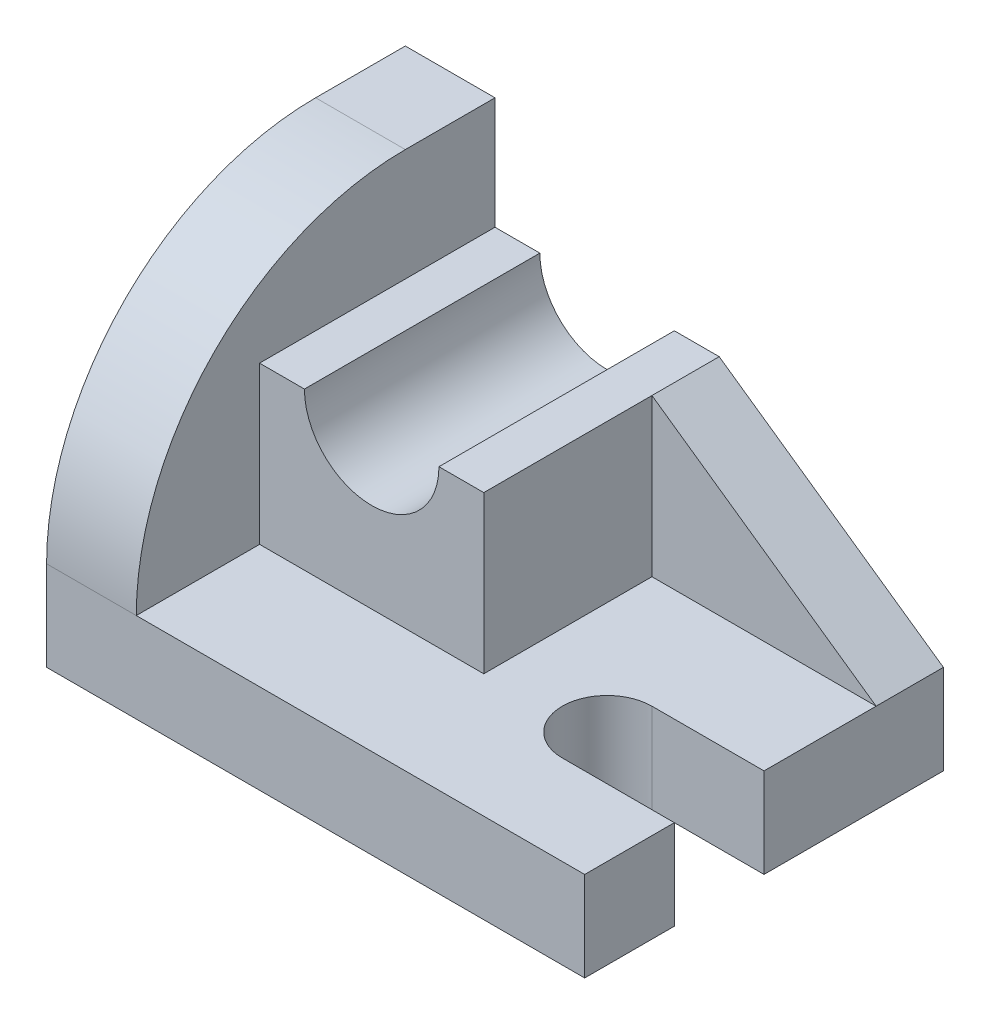
ISO-10303-21;
HEADER;
FILE_DESCRIPTION(('STEP AP214'),'2;1');
FILE_NAME('part.step','',(''),(''),'','','');
FILE_SCHEMA(('AUTOMOTIVE_DESIGN { 1 0 10303 214 1 1 1 1 }'));
ENDSEC;
DATA;
#1=APPLICATION_CONTEXT('core data for automotive mechanical design processes');
#2=APPLICATION_PROTOCOL_DEFINITION('international standard','automotive_design',2000,#1);
#3=PRODUCT_CONTEXT('',#1,'mechanical');
#4=PRODUCT('Part','Part','',(#3));
#5=PRODUCT_RELATED_PRODUCT_CATEGORY('part','',(#4));
#6=PRODUCT_DEFINITION_FORMATION('','',#4);
#7=PRODUCT_DEFINITION_CONTEXT('part definition',#1,'design');
#8=PRODUCT_DEFINITION('design','',#6,#7);
#9=PRODUCT_DEFINITION_SHAPE('','',#8);
#10=(LENGTH_UNIT() NAMED_UNIT(*) SI_UNIT(.MILLI.,.METRE.));
#11=(NAMED_UNIT(*) PLANE_ANGLE_UNIT() SI_UNIT($,.RADIAN.));
#12=(NAMED_UNIT(*) SI_UNIT($,.STERADIAN.) SOLID_ANGLE_UNIT());
#13=UNCERTAINTY_MEASURE_WITH_UNIT(LENGTH_MEASURE(1.E-05),#10,'distance_accuracy_value','');
#14=(GEOMETRIC_REPRESENTATION_CONTEXT(3) GLOBAL_UNCERTAINTY_ASSIGNED_CONTEXT((#13)) GLOBAL_UNIT_ASSIGNED_CONTEXT((#10,
#11,#12)) REPRESENTATION_CONTEXT('',''));
#15=CARTESIAN_POINT('',(0.,0.,0.));
#16=DIRECTION('',(0.,0.,1.));
#17=DIRECTION('',(1.,0.,0.));
#18=AXIS2_PLACEMENT_3D('',#15,#16,#17);
#19=CARTESIAN_POINT('',(48.,16.,-32.));
#20=DIRECTION('',(-1.,0.,0.));
#21=DIRECTION('',(0.,0.,1.));
#22=AXIS2_PLACEMENT_3D('',#19,#20,#21);
#23=PLANE('',#22);
#24=DIRECTION('',(0.,0.,-1.));
#25=VECTOR('',#24,1.);
#26=CARTESIAN_POINT('',(48.,16.,-32.));
#27=LINE('',#26,#25);
#28=CARTESIAN_POINT('',(48.,16.,0.));
#29=VERTEX_POINT('',#28);
#30=CARTESIAN_POINT('',(48.,16.,-20.));
#31=VERTEX_POINT('',#30);
#32=EDGE_CURVE('E241',#29,#31,#27,.T.);
#33=ORIENTED_EDGE('',*,*,#32,.F.);
#34=DIRECTION('',(0.,1.,0.));
#35=VECTOR('',#34,1.);
#36=CARTESIAN_POINT('',(48.,0.,0.));
#37=LINE('',#36,#35);
#38=CARTESIAN_POINT('',(48.,0.,0.));
#39=VERTEX_POINT('',#38);
#40=EDGE_CURVE('E180',#39,#29,#37,.T.);
#41=ORIENTED_EDGE('',*,*,#40,.F.);
#42=DIRECTION('',(0.,0.,-1.));
#43=VECTOR('',#42,1.);
#44=CARTESIAN_POINT('',(48.,0.,-32.));
#45=LINE('',#44,#43);
#46=CARTESIAN_POINT('',(48.,0.,-32.));
#47=VERTEX_POINT('',#46);
#48=EDGE_CURVE('E236',#39,#47,#45,.T.);
#49=ORIENTED_EDGE('',*,*,#48,.T.);
#50=DIRECTION('',(0.,-1.,0.));
#51=VECTOR('',#50,1.);
#52=CARTESIAN_POINT('',(48.,16.,-32.));
#53=LINE('',#52,#51);
#54=CARTESIAN_POINT('',(48.,16.,-32.));
#55=VERTEX_POINT('',#54);
#56=EDGE_CURVE('E260',#55,#47,#53,.T.);
#57=ORIENTED_EDGE('',*,*,#56,.F.);
#58=DIRECTION('',(0.,0.,-1.));
#59=VECTOR('',#58,1.);
#60=CARTESIAN_POINT('',(48.,16.,-20.));
#61=LINE('',#60,#59);
#62=EDGE_CURVE('E192',#31,#55,#61,.T.);
#63=ORIENTED_EDGE('',*,*,#62,.F.);
#64=EDGE_LOOP('',(#33,#41,#49,#57,#63));
#65=FACE_BOUND('',#64,.T.);
#66=ADVANCED_FACE('F33',(#65),#23,.F.);
#67=CARTESIAN_POINT('',(0.,16.,0.));
#68=DIRECTION('',(0.,1.,0.));
#69=DIRECTION('',(0.,0.,1.));
#70=AXIS2_PLACEMENT_3D('',#67,#68,#69);
#71=PLANE('',#70);
#72=DIRECTION('',(-1.,0.,0.));
#73=VECTOR('',#72,1.);
#74=CARTESIAN_POINT('',(28.,16.,0.));
#75=LINE('',#74,#73);
#76=CARTESIAN_POINT('',(28.,16.,0.));
#77=VERTEX_POINT('',#76);
#78=EDGE_CURVE('E168',#29,#77,#75,.T.);
#79=ORIENTED_EDGE('',*,*,#78,.F.);
#80=ORIENTED_EDGE('',*,*,#32,.T.);
#81=DIRECTION('',(-1.,0.,0.));
#82=VECTOR('',#81,1.);
#83=CARTESIAN_POINT('',(48.,16.,-20.));
#84=LINE('',#83,#82);
#85=CARTESIAN_POINT('',(8.00000000000002,16.,-20.));
#86=VERTEX_POINT('',#85);
#87=EDGE_CURVE('E183',#31,#86,#84,.T.);
#88=ORIENTED_EDGE('',*,*,#87,.T.);
#89=DIRECTION('',(0.,0.,1.));
#90=VECTOR('',#89,1.);
#91=CARTESIAN_POINT('',(8.00000000000002,16.,-32.));
#92=LINE('',#91,#90);
#93=CARTESIAN_POINT('',(8.00000000000003,16.,10.));
#94=VERTEX_POINT('',#93);
#95=EDGE_CURVE('E216',#86,#94,#92,.T.);
#96=ORIENTED_EDGE('',*,*,#95,.T.);
#97=DIRECTION('',(1.,0.,0.));
#98=VECTOR('',#97,1.);
#99=CARTESIAN_POINT('',(-32.,16.,10.));
#100=LINE('',#99,#98);
#101=CARTESIAN_POINT('',(-32.,16.,10.));
#102=VERTEX_POINT('',#101);
#103=EDGE_CURVE('E198',#102,#94,#100,.T.);
#104=ORIENTED_EDGE('',*,*,#103,.F.);
#105=DIRECTION('',(0.,0.,1.));
#106=VECTOR('',#105,1.);
#107=CARTESIAN_POINT('',(-32.,16.,-32.));
#108=LINE('',#107,#106);
#109=CARTESIAN_POINT('',(-32.,16.,32.));
#110=VERTEX_POINT('',#109);
#111=EDGE_CURVE('E222',#102,#110,#108,.T.);
#112=ORIENTED_EDGE('',*,*,#111,.T.);
#113=DIRECTION('',(1.,0.,0.));
#114=VECTOR('',#113,1.);
#115=CARTESIAN_POINT('',(-48.,16.,32.));
#116=LINE('',#115,#114);
#117=CARTESIAN_POINT('',(48.,16.,32.));
#118=VERTEX_POINT('',#117);
#119=EDGE_CURVE('E240',#110,#118,#116,.T.);
#120=ORIENTED_EDGE('',*,*,#119,.T.);
#121=CARTESIAN_POINT('',(48.,16.,16.));
#122=VERTEX_POINT('',#121);
#123=EDGE_CURVE('E237',#118,#122,#27,.T.);
#124=ORIENTED_EDGE('',*,*,#123,.T.);
#125=DIRECTION('',(1.,0.,0.));
#126=VECTOR('',#125,1.);
#127=CARTESIAN_POINT('',(28.,16.,16.));
#128=LINE('',#127,#126);
#129=CARTESIAN_POINT('',(28.,16.,16.));
#130=VERTEX_POINT('',#129);
#131=EDGE_CURVE('E171',#130,#122,#128,.T.);
#132=ORIENTED_EDGE('',*,*,#131,.F.);
#133=CARTESIAN_POINT('',(28.,16.,8.00000000000001));
#134=DIRECTION('',(0.,1.,0.));
#135=DIRECTION('',(0.,0.,1.));
#136=AXIS2_PLACEMENT_3D('',#133,#134,#135);
#137=CIRCLE('',#136,8.);
#138=EDGE_CURVE('E156',#77,#130,#137,.T.);
#139=ORIENTED_EDGE('',*,*,#138,.F.);
#140=EDGE_LOOP('',(#79,#80,#88,#96,#104,#112,#120,#124,#132,#139));
#141=FACE_BOUND('',#140,.T.);
#142=ADVANCED_FACE('F302',(#141),#71,.T.);
#143=CARTESIAN_POINT('',(8.00000000000002,44.,-32.));
#144=DIRECTION('',(1.,0.,0.));
#145=DIRECTION('',(0.,0.,-1.));
#146=AXIS2_PLACEMENT_3D('',#143,#144,#145);
#147=PLANE('',#146);
#148=ORIENTED_EDGE('',*,*,#95,.F.);
#149=DIRECTION('',(0.,1.,0.));
#150=VECTOR('',#149,1.);
#151=CARTESIAN_POINT('',(8.00000000000002,16.,-20.));
#152=LINE('',#151,#150);
#153=CARTESIAN_POINT('',(8.00000000000002,44.,-20.));
#154=VERTEX_POINT('',#153);
#155=EDGE_CURVE('E186',#86,#154,#152,.T.);
#156=ORIENTED_EDGE('',*,*,#155,.T.);
#157=DIRECTION('',(0.,0.,1.));
#158=VECTOR('',#157,1.);
#159=CARTESIAN_POINT('',(8.00000000000002,44.,-32.));
#160=LINE('',#159,#158);
#161=CARTESIAN_POINT('',(8.00000000000003,44.,10.));
#162=VERTEX_POINT('',#161);
#163=EDGE_CURVE('E203',#154,#162,#160,.T.);
#164=ORIENTED_EDGE('',*,*,#163,.T.);
#165=DIRECTION('',(0.,-1.,0.));
#166=VECTOR('',#165,1.);
#167=CARTESIAN_POINT('',(8.00000000000003,44.,10.));
#168=LINE('',#167,#166);
#169=EDGE_CURVE('E219',#162,#94,#168,.T.);
#170=ORIENTED_EDGE('',*,*,#169,.T.);
#171=EDGE_LOOP('',(#148,#156,#164,#170));
#172=FACE_BOUND('',#171,.T.);
#173=ADVANCED_FACE('F339',(#172),#147,.T.);
#174=CARTESIAN_POINT('',(0.,44.,0.));
#175=DIRECTION('',(0.,-1.,0.));
#176=DIRECTION('',(0.,0.,-1.));
#177=AXIS2_PLACEMENT_3D('',#174,#175,#176);
#178=PLANE('',#177);
#179=DIRECTION('',(1.,0.,0.));
#180=VECTOR('',#179,1.);
#181=CARTESIAN_POINT('',(-32.,44.,-32.));
#182=LINE('',#181,#180);
#183=CARTESIAN_POINT('',(0.,44.,-32.));
#184=VERTEX_POINT('',#183);
#185=CARTESIAN_POINT('',(8.00000000000002,44.,-32.));
#186=VERTEX_POINT('',#185);
#187=EDGE_CURVE('E207',#184,#186,#182,.T.);
#188=ORIENTED_EDGE('',*,*,#187,.F.);
#189=DIRECTION('',(0.,0.,1.));
#190=VECTOR('',#189,1.);
#191=CARTESIAN_POINT('',(0.,44.,-32.));
#192=LINE('',#191,#190);
#193=CARTESIAN_POINT('',(0.,44.,10.));
#194=VERTEX_POINT('',#193);
#195=EDGE_CURVE('E11',#184,#194,#192,.T.);
#196=ORIENTED_EDGE('',*,*,#195,.T.);
#197=DIRECTION('',(1.,0.,0.));
#198=VECTOR('',#197,1.);
#199=CARTESIAN_POINT('',(-32.,44.,10.));
#200=LINE('',#199,#198);
#201=EDGE_CURVE('E204',#194,#162,#200,.T.);
#202=ORIENTED_EDGE('',*,*,#201,.T.);
#203=ORIENTED_EDGE('',*,*,#163,.F.);
#204=EDGE_CURVE('E205',#186,#154,#160,.T.);
#205=ORIENTED_EDGE('',*,*,#204,.F.);
#206=EDGE_LOOP('',(#188,#196,#202,#203,#205));
#207=FACE_BOUND('',#206,.T.);
#208=ADVANCED_FACE('F312',(#207),#178,.F.);
#209=CARTESIAN_POINT('',(-32.,64.,-32.));
#210=DIRECTION('',(1.,0.,0.));
#211=DIRECTION('',(0.,0.,-1.));
#212=AXIS2_PLACEMENT_3D('',#209,#210,#211);
#213=PLANE('',#212);
#214=ORIENTED_EDGE('',*,*,#111,.F.);
#215=DIRECTION('',(0.,-1.,0.));
#216=VECTOR('',#215,1.);
#217=CARTESIAN_POINT('',(-32.,44.,10.));
#218=LINE('',#217,#216);
#219=CARTESIAN_POINT('',(-32.,44.,10.));
#220=VERTEX_POINT('',#219);
#221=EDGE_CURVE('E213',#220,#102,#218,.T.);
#222=ORIENTED_EDGE('',*,*,#221,.F.);
#223=DIRECTION('',(0.,0.,1.));
#224=VECTOR('',#223,1.);
#225=CARTESIAN_POINT('',(-32.,44.,-32.));
#226=LINE('',#225,#224);
#227=CARTESIAN_POINT('',(-32.,44.,-32.));
#228=VERTEX_POINT('',#227);
#229=EDGE_CURVE('E211',#228,#220,#226,.T.);
#230=ORIENTED_EDGE('',*,*,#229,.F.);
#231=DIRECTION('',(0.,-1.,0.));
#232=VECTOR('',#231,1.);
#233=CARTESIAN_POINT('',(-32.,64.,-32.));
#234=LINE('',#233,#232);
#235=CARTESIAN_POINT('',(-32.,64.,-32.));
#236=VERTEX_POINT('',#235);
#237=EDGE_CURVE('E232',#236,#228,#234,.T.);
#238=ORIENTED_EDGE('',*,*,#237,.F.);
#239=DIRECTION('',(0.,0.,1.));
#240=VECTOR('',#239,1.);
#241=CARTESIAN_POINT('',(-32.,64.,-32.));
#242=LINE('',#241,#240);
#243=CARTESIAN_POINT('',(-32.,64.,-16.));
#244=VERTEX_POINT('',#243);
#245=EDGE_CURVE('E223',#236,#244,#242,.T.);
#246=ORIENTED_EDGE('',*,*,#245,.T.);
#247=CARTESIAN_POINT('',(-32.,16.,-16.));
#248=DIRECTION('',(1.,0.,0.));
#249=DIRECTION('',(0.,0.,-1.));
#250=AXIS2_PLACEMENT_3D('',#247,#248,#249);
#251=CIRCLE('',#250,48.);
#252=EDGE_CURVE('E266',#244,#110,#251,.T.);
#253=ORIENTED_EDGE('',*,*,#252,.T.);
#254=EDGE_LOOP('',(#214,#222,#230,#238,#246,#253));
#255=FACE_BOUND('',#254,.T.);
#256=ADVANCED_FACE('F285',(#255),#213,.T.);
#257=CARTESIAN_POINT('',(48.,0.,32.));
#258=VERTEX_POINT('',#257);
#259=CARTESIAN_POINT('',(48.,0.,16.));
#260=VERTEX_POINT('',#259);
#261=EDGE_CURVE('E244',#258,#260,#45,.T.);
#262=ORIENTED_EDGE('',*,*,#261,.T.);
#263=DIRECTION('',(0.,1.,0.));
#264=VECTOR('',#263,1.);
#265=CARTESIAN_POINT('',(48.,0.,16.));
#266=LINE('',#265,#264);
#267=EDGE_CURVE('E48',#260,#122,#266,.T.);
#268=ORIENTED_EDGE('',*,*,#267,.T.);
#269=ORIENTED_EDGE('',*,*,#123,.F.);
#270=DIRECTION('',(0.,-1.,0.));
#271=VECTOR('',#270,1.);
#272=CARTESIAN_POINT('',(48.,16.,32.));
#273=LINE('',#272,#271);
#274=EDGE_CURVE('E243',#118,#258,#273,.T.);
#275=ORIENTED_EDGE('',*,*,#274,.T.);
#276=EDGE_LOOP('',(#262,#268,#269,#275));
#277=FACE_BOUND('',#276,.T.);
#278=ADVANCED_FACE('F327',(#277),#23,.F.);
#279=CARTESIAN_POINT('',(-48.,16.,-32.));
#280=DIRECTION('',(0.,0.,1.));
#281=DIRECTION('',(1.,0.,0.));
#282=AXIS2_PLACEMENT_3D('',#279,#280,#281);
#283=PLANE('',#282);
#284=CARTESIAN_POINT('',(-24.,44.,-32.));
#285=VERTEX_POINT('',#284);
#286=EDGE_CURVE('E208',#228,#285,#182,.T.);
#287=ORIENTED_EDGE('',*,*,#286,.T.);
#288=CARTESIAN_POINT('',(-12.,44.,-32.));
#289=DIRECTION('',(0.,0.,1.));
#290=DIRECTION('',(1.,0.,0.));
#291=AXIS2_PLACEMENT_3D('',#288,#289,#290);
#292=CIRCLE('',#291,12.);
#293=EDGE_CURVE('E56',#285,#184,#292,.T.);
#294=ORIENTED_EDGE('',*,*,#293,.T.);
#295=ORIENTED_EDGE('',*,*,#187,.T.);
#296=DIRECTION('',(0.819231920519041,-0.573462344363328,0.));
#297=VECTOR('',#296,1.);
#298=CARTESIAN_POINT('',(8.00000000000002,44.,-32.));
#299=LINE('',#298,#297);
#300=EDGE_CURVE('E179',#186,#55,#299,.T.);
#301=ORIENTED_EDGE('',*,*,#300,.T.);
#302=ORIENTED_EDGE('',*,*,#56,.T.);
#303=DIRECTION('',(-1.,0.,0.));
#304=VECTOR('',#303,1.);
#305=CARTESIAN_POINT('',(-48.,0.,-32.));
#306=LINE('',#305,#304);
#307=CARTESIAN_POINT('',(-48.,0.,-32.));
#308=VERTEX_POINT('',#307);
#309=EDGE_CURVE('E246',#47,#308,#306,.T.);
#310=ORIENTED_EDGE('',*,*,#309,.T.);
#311=DIRECTION('',(0.,-1.,0.));
#312=VECTOR('',#311,1.);
#313=CARTESIAN_POINT('',(-48.,16.,-32.));
#314=LINE('',#313,#312);
#315=CARTESIAN_POINT('',(-48.,64.,-32.));
#316=VERTEX_POINT('',#315);
#317=EDGE_CURVE('E257',#316,#308,#314,.T.);
#318=ORIENTED_EDGE('',*,*,#317,.F.);
#319=DIRECTION('',(1.,0.,0.));
#320=VECTOR('',#319,1.);
#321=CARTESIAN_POINT('',(-48.,64.,-32.));
#322=LINE('',#321,#320);
#323=EDGE_CURVE('E226',#316,#236,#322,.T.);
#324=ORIENTED_EDGE('',*,*,#323,.T.);
#325=ORIENTED_EDGE('',*,*,#237,.T.);
#326=EDGE_LOOP('',(#287,#294,#295,#301,#302,#310,#318,#324,#325));
#327=FACE_BOUND('',#326,.T.);
#328=ADVANCED_FACE('F278',(#327),#283,.F.);
#329=CARTESIAN_POINT('',(-48.,16.,-32.));
#330=DIRECTION('',(1.,0.,0.));
#331=DIRECTION('',(0.,0.,-1.));
#332=AXIS2_PLACEMENT_3D('',#329,#330,#331);
#333=PLANE('',#332);
#334=DIRECTION('',(0.,-1.,0.));
#335=VECTOR('',#334,1.);
#336=CARTESIAN_POINT('',(-48.,16.,32.));
#337=LINE('',#336,#335);
#338=CARTESIAN_POINT('',(-48.,16.,32.));
#339=VERTEX_POINT('',#338);
#340=CARTESIAN_POINT('',(-48.,0.,32.));
#341=VERTEX_POINT('',#340);
#342=EDGE_CURVE('E255',#339,#341,#337,.T.);
#343=ORIENTED_EDGE('',*,*,#342,.F.);
#344=CARTESIAN_POINT('',(-48.,16.,-16.));
#345=DIRECTION('',(1.,0.,0.));
#346=DIRECTION('',(0.,0.,-1.));
#347=AXIS2_PLACEMENT_3D('',#344,#345,#346);
#348=CIRCLE('',#347,48.);
#349=CARTESIAN_POINT('',(-48.,64.,-16.));
#350=VERTEX_POINT('',#349);
#351=EDGE_CURVE('E271',#339,#350,#348,.F.);
#352=ORIENTED_EDGE('',*,*,#351,.T.);
#353=DIRECTION('',(0.,0.,1.));
#354=VECTOR('',#353,1.);
#355=CARTESIAN_POINT('',(-48.,64.,-32.));
#356=LINE('',#355,#354);
#357=EDGE_CURVE('E229',#316,#350,#356,.T.);
#358=ORIENTED_EDGE('',*,*,#357,.F.);
#359=ORIENTED_EDGE('',*,*,#317,.T.);
#360=DIRECTION('',(0.,0.,1.));
#361=VECTOR('',#360,1.);
#362=CARTESIAN_POINT('',(-48.,0.,-32.));
#363=LINE('',#362,#361);
#364=EDGE_CURVE('E248',#308,#341,#363,.T.);
#365=ORIENTED_EDGE('',*,*,#364,.T.);
#366=EDGE_LOOP('',(#343,#352,#358,#359,#365));
#367=FACE_BOUND('',#366,.T.);
#368=ADVANCED_FACE('F325',(#367),#333,.F.);
#369=CARTESIAN_POINT('',(-48.,16.,32.));
#370=DIRECTION('',(0.,0.,-1.));
#371=DIRECTION('',(-1.,0.,0.));
#372=AXIS2_PLACEMENT_3D('',#369,#370,#371);
#373=PLANE('',#372);
#374=ORIENTED_EDGE('',*,*,#119,.F.);
#375=DIRECTION('',(1.,0.,0.));
#376=VECTOR('',#375,1.);
#377=CARTESIAN_POINT('',(-48.,16.,32.));
#378=LINE('',#377,#376);
#379=EDGE_CURVE('E269',#110,#339,#378,.F.);
#380=ORIENTED_EDGE('',*,*,#379,.T.);
#381=ORIENTED_EDGE('',*,*,#342,.T.);
#382=DIRECTION('',(1.,0.,0.));
#383=VECTOR('',#382,1.);
#384=CARTESIAN_POINT('',(-48.,0.,32.));
#385=LINE('',#384,#383);
#386=EDGE_CURVE('E251',#341,#258,#385,.T.);
#387=ORIENTED_EDGE('',*,*,#386,.T.);
#388=ORIENTED_EDGE('',*,*,#274,.F.);
#389=EDGE_LOOP('',(#374,#380,#381,#387,#388));
#390=FACE_BOUND('',#389,.T.);
#391=ADVANCED_FACE('F297',(#390),#373,.F.);
#392=CARTESIAN_POINT('',(0.,0.,0.));
#393=DIRECTION('',(0.,1.,0.));
#394=DIRECTION('',(0.,0.,1.));
#395=AXIS2_PLACEMENT_3D('',#392,#393,#394);
#396=PLANE('',#395);
#397=ORIENTED_EDGE('',*,*,#48,.F.);
#398=DIRECTION('',(-1.,0.,0.));
#399=VECTOR('',#398,1.);
#400=CARTESIAN_POINT('',(28.,0.,0.));
#401=LINE('',#400,#399);
#402=CARTESIAN_POINT('',(28.,0.,0.));
#403=VERTEX_POINT('',#402);
#404=EDGE_CURVE('E158',#39,#403,#401,.T.);
#405=ORIENTED_EDGE('',*,*,#404,.T.);
#406=CARTESIAN_POINT('',(28.,0.,8.00000000000001));
#407=DIRECTION('',(0.,1.,0.));
#408=DIRECTION('',(0.,0.,1.));
#409=AXIS2_PLACEMENT_3D('',#406,#407,#408);
#410=CIRCLE('',#409,8.);
#411=CARTESIAN_POINT('',(28.,0.,16.));
#412=VERTEX_POINT('',#411);
#413=EDGE_CURVE('E153',#403,#412,#410,.T.);
#414=ORIENTED_EDGE('',*,*,#413,.T.);
#415=DIRECTION('',(1.,0.,0.));
#416=VECTOR('',#415,1.);
#417=CARTESIAN_POINT('',(28.,0.,16.));
#418=LINE('',#417,#416);
#419=EDGE_CURVE('E160',#412,#260,#418,.T.);
#420=ORIENTED_EDGE('',*,*,#419,.T.);
#421=ORIENTED_EDGE('',*,*,#261,.F.);
#422=ORIENTED_EDGE('',*,*,#386,.F.);
#423=ORIENTED_EDGE('',*,*,#364,.F.);
#424=ORIENTED_EDGE('',*,*,#309,.F.);
#425=EDGE_LOOP('',(#397,#405,#414,#420,#421,#422,#423,#424));
#426=FACE_BOUND('',#425,.T.);
#427=ADVANCED_FACE('F167',(#426),#396,.F.);
#428=CARTESIAN_POINT('',(0.,64.,0.));
#429=DIRECTION('',(0.,-1.,0.));
#430=DIRECTION('',(0.,0.,-1.));
#431=AXIS2_PLACEMENT_3D('',#428,#429,#430);
#432=PLANE('',#431);
#433=ORIENTED_EDGE('',*,*,#357,.T.);
#434=DIRECTION('',(1.,0.,0.));
#435=VECTOR('',#434,1.);
#436=CARTESIAN_POINT('',(0.,64.,-16.));
#437=LINE('',#436,#435);
#438=EDGE_CURVE('E263',#350,#244,#437,.T.);
#439=ORIENTED_EDGE('',*,*,#438,.T.);
#440=ORIENTED_EDGE('',*,*,#245,.F.);
#441=ORIENTED_EDGE('',*,*,#323,.F.);
#442=EDGE_LOOP('',(#433,#439,#440,#441));
#443=FACE_BOUND('',#442,.T.);
#444=ADVANCED_FACE('F288',(#443),#432,.F.);
#445=CARTESIAN_POINT('',(0.,16.,-16.));
#446=DIRECTION('',(1.,0.,0.));
#447=DIRECTION('',(0.,0.,-1.));
#448=AXIS2_PLACEMENT_3D('',#445,#446,#447);
#449=CYLINDRICAL_SURFACE('',#448,48.);
#450=ORIENTED_EDGE('',*,*,#351,.F.);
#451=ORIENTED_EDGE('',*,*,#379,.F.);
#452=ORIENTED_EDGE('',*,*,#252,.F.);
#453=ORIENTED_EDGE('',*,*,#438,.F.);
#454=EDGE_LOOP('',(#450,#451,#452,#453));
#455=FACE_BOUND('',#454,.T.);
#456=ADVANCED_FACE('F35',(#455),#449,.T.);
#457=CARTESIAN_POINT('',(-32.,44.,10.));
#458=DIRECTION('',(0.,0.,-1.));
#459=DIRECTION('',(-1.,0.,0.));
#460=AXIS2_PLACEMENT_3D('',#457,#458,#459);
#461=PLANE('',#460);
#462=ORIENTED_EDGE('',*,*,#201,.F.);
#463=CARTESIAN_POINT('',(-12.,44.,10.));
#464=DIRECTION('',(0.,0.,1.));
#465=DIRECTION('',(1.,0.,0.));
#466=AXIS2_PLACEMENT_3D('',#463,#464,#465);
#467=CIRCLE('',#466,12.);
#468=CARTESIAN_POINT('',(-24.,44.,10.));
#469=VERTEX_POINT('',#468);
#470=EDGE_CURVE('E196',#469,#194,#467,.T.);
#471=ORIENTED_EDGE('',*,*,#470,.F.);
#472=EDGE_CURVE('E200',#220,#469,#200,.T.);
#473=ORIENTED_EDGE('',*,*,#472,.F.);
#474=ORIENTED_EDGE('',*,*,#221,.T.);
#475=ORIENTED_EDGE('',*,*,#103,.T.);
#476=ORIENTED_EDGE('',*,*,#169,.F.);
#477=EDGE_LOOP('',(#462,#471,#473,#474,#475,#476));
#478=FACE_BOUND('',#477,.T.);
#479=ADVANCED_FACE('F308',(#478),#461,.F.);
#480=ORIENTED_EDGE('',*,*,#472,.T.);
#481=DIRECTION('',(0.,0.,1.));
#482=VECTOR('',#481,1.);
#483=CARTESIAN_POINT('',(-24.,44.,-32.));
#484=LINE('',#483,#482);
#485=EDGE_CURVE('E41',#469,#285,#484,.F.);
#486=ORIENTED_EDGE('',*,*,#485,.T.);
#487=ORIENTED_EDGE('',*,*,#286,.F.);
#488=ORIENTED_EDGE('',*,*,#229,.T.);
#489=EDGE_LOOP('',(#480,#486,#487,#488));
#490=FACE_BOUND('',#489,.T.);
#491=ADVANCED_FACE('F273',(#490),#178,.F.);
#492=CARTESIAN_POINT('',(-12.,44.,-32.));
#493=DIRECTION('',(0.,0.,1.));
#494=DIRECTION('',(1.,0.,0.));
#495=AXIS2_PLACEMENT_3D('',#492,#493,#494);
#496=CYLINDRICAL_SURFACE('',#495,12.);
#497=ORIENTED_EDGE('',*,*,#293,.F.);
#498=ORIENTED_EDGE('',*,*,#485,.F.);
#499=ORIENTED_EDGE('',*,*,#470,.T.);
#500=ORIENTED_EDGE('',*,*,#195,.F.);
#501=EDGE_LOOP('',(#497,#498,#499,#500));
#502=FACE_BOUND('',#501,.T.);
#503=ADVANCED_FACE('F310',(#502),#496,.F.);
#504=CARTESIAN_POINT('',(8.00000000000002,44.,-20.));
#505=DIRECTION('',(0.573462344363328,0.81923192051904,0.));
#506=DIRECTION('',(-0.819231920519041,0.573462344363328,0.));
#507=AXIS2_PLACEMENT_3D('',#504,#505,#506);
#508=PLANE('',#507);
#509=ORIENTED_EDGE('',*,*,#300,.F.);
#510=ORIENTED_EDGE('',*,*,#204,.T.);
#511=DIRECTION('',(0.819231920519041,-0.573462344363328,0.));
#512=VECTOR('',#511,1.);
#513=CARTESIAN_POINT('',(8.00000000000002,44.,-20.));
#514=LINE('',#513,#512);
#515=EDGE_CURVE('E189',#154,#31,#514,.T.);
#516=ORIENTED_EDGE('',*,*,#515,.T.);
#517=ORIENTED_EDGE('',*,*,#62,.T.);
#518=EDGE_LOOP('',(#509,#510,#516,#517));
#519=FACE_BOUND('',#518,.T.);
#520=ADVANCED_FACE('F395',(#519),#508,.T.);
#521=CARTESIAN_POINT('',(0.,0.,-20.));
#522=DIRECTION('',(0.,0.,-1.));
#523=DIRECTION('',(-1.,0.,0.));
#524=AXIS2_PLACEMENT_3D('',#521,#522,#523);
#525=PLANE('',#524);
#526=ORIENTED_EDGE('',*,*,#87,.F.);
#527=ORIENTED_EDGE('',*,*,#515,.F.);
#528=ORIENTED_EDGE('',*,*,#155,.F.);
#529=EDGE_LOOP('',(#526,#527,#528));
#530=FACE_BOUND('',#529,.T.);
#531=ADVANCED_FACE('F403',(#530),#525,.F.);
#532=CARTESIAN_POINT('',(28.,0.,8.00000000000001));
#533=DIRECTION('',(0.,1.,0.));
#534=DIRECTION('',(0.,0.,1.));
#535=AXIS2_PLACEMENT_3D('',#532,#533,#534);
#536=CYLINDRICAL_SURFACE('',#535,8.);
#537=ORIENTED_EDGE('',*,*,#138,.T.);
#538=DIRECTION('',(0.,1.,0.));
#539=VECTOR('',#538,1.);
#540=CARTESIAN_POINT('',(28.,0.,16.));
#541=LINE('',#540,#539);
#542=EDGE_CURVE('E150',#412,#130,#541,.T.);
#543=ORIENTED_EDGE('',*,*,#542,.F.);
#544=ORIENTED_EDGE('',*,*,#413,.F.);
#545=DIRECTION('',(0.,1.,0.));
#546=VECTOR('',#545,1.);
#547=CARTESIAN_POINT('',(28.,0.,0.));
#548=LINE('',#547,#546);
#549=EDGE_CURVE('E177',#403,#77,#548,.T.);
#550=ORIENTED_EDGE('',*,*,#549,.T.);
#551=EDGE_LOOP('',(#537,#543,#544,#550));
#552=FACE_BOUND('',#551,.T.);
#553=ADVANCED_FACE('F151',(#552),#536,.F.);
#554=CARTESIAN_POINT('',(28.,0.,0.));
#555=DIRECTION('',(0.,0.,-1.));
#556=DIRECTION('',(-1.,0.,0.));
#557=AXIS2_PLACEMENT_3D('',#554,#555,#556);
#558=PLANE('',#557);
#559=ORIENTED_EDGE('',*,*,#78,.T.);
#560=ORIENTED_EDGE('',*,*,#549,.F.);
#561=ORIENTED_EDGE('',*,*,#404,.F.);
#562=ORIENTED_EDGE('',*,*,#40,.T.);
#563=EDGE_LOOP('',(#559,#560,#561,#562));
#564=FACE_BOUND('',#563,.T.);
#565=ADVANCED_FACE('F416',(#564),#558,.F.);
#566=CARTESIAN_POINT('',(28.,0.,16.));
#567=DIRECTION('',(0.,0.,1.));
#568=DIRECTION('',(1.,0.,0.));
#569=AXIS2_PLACEMENT_3D('',#566,#567,#568);
#570=PLANE('',#569);
#571=ORIENTED_EDGE('',*,*,#131,.T.);
#572=ORIENTED_EDGE('',*,*,#267,.F.);
#573=ORIENTED_EDGE('',*,*,#419,.F.);
#574=ORIENTED_EDGE('',*,*,#542,.T.);
#575=EDGE_LOOP('',(#571,#572,#573,#574));
#576=FACE_BOUND('',#575,.T.);
#577=ADVANCED_FACE('F161',(#576),#570,.F.);
#578=CLOSED_SHELL('',(#66,#142,#173,#208,#256,#278,#328,#368,#391,#427,#444,#456,#479,#491,#503,
#520,#531,#553,#565,#577));
#579=MANIFOLD_SOLID_BREP('B2',#578);
#580=ADVANCED_BREP_SHAPE_REPRESENTATION('',(#18,#579),#14);
#581=SHAPE_DEFINITION_REPRESENTATION(#9,#580);
ENDSEC;
END-ISO-10303-21;
